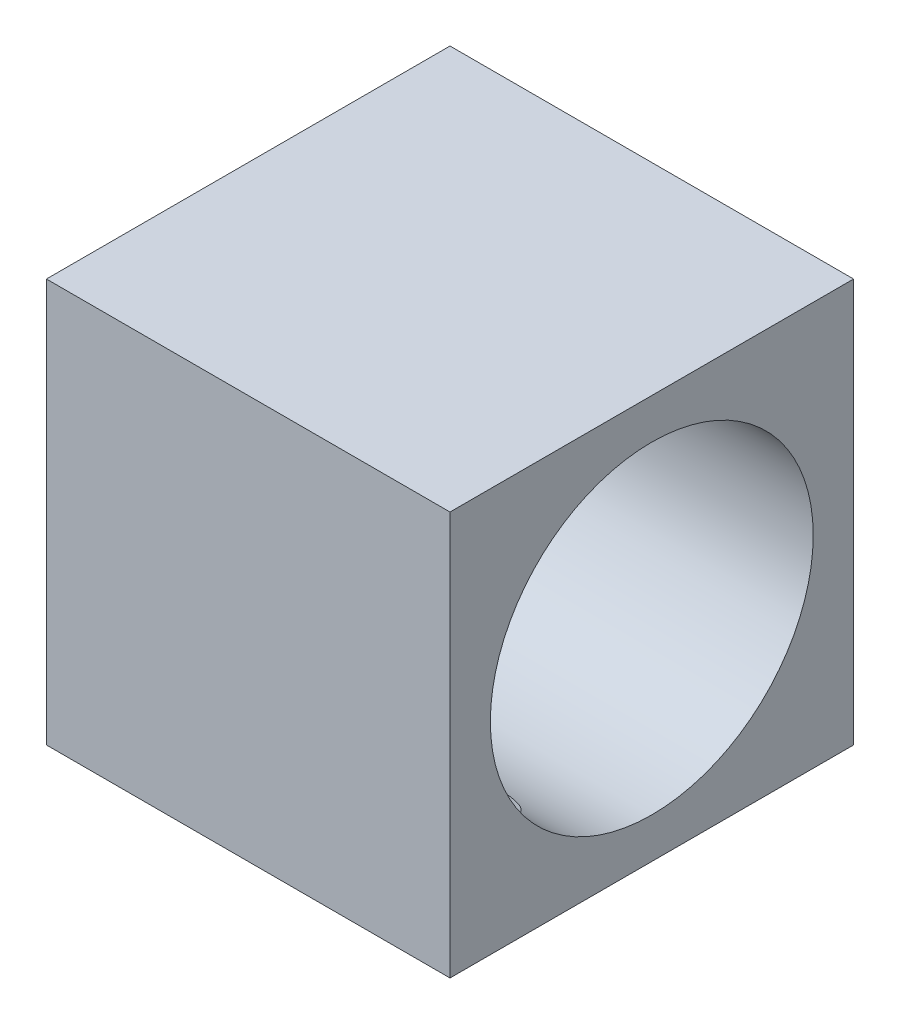
ISO-10303-21;
HEADER;
FILE_DESCRIPTION(('STEP AP214'),'2;1');
FILE_NAME('part.step','',(''),(''),'','','');
FILE_SCHEMA(('AUTOMOTIVE_DESIGN { 1 0 10303 214 1 1 1 1 }'));
ENDSEC;
DATA;
#1=APPLICATION_CONTEXT('core data for automotive mechanical design processes');
#2=APPLICATION_PROTOCOL_DEFINITION('international standard','automotive_design',2000,#1);
#3=PRODUCT_CONTEXT('',#1,'mechanical');
#4=PRODUCT('Part','Part','',(#3));
#5=PRODUCT_RELATED_PRODUCT_CATEGORY('part','',(#4));
#6=PRODUCT_DEFINITION_FORMATION('','',#4);
#7=PRODUCT_DEFINITION_CONTEXT('part definition',#1,'design');
#8=PRODUCT_DEFINITION('design','',#6,#7);
#9=PRODUCT_DEFINITION_SHAPE('','',#8);
#10=(LENGTH_UNIT() NAMED_UNIT(*) SI_UNIT(.MILLI.,.METRE.));
#11=(NAMED_UNIT(*) PLANE_ANGLE_UNIT() SI_UNIT($,.RADIAN.));
#12=(NAMED_UNIT(*) SI_UNIT($,.STERADIAN.) SOLID_ANGLE_UNIT());
#13=UNCERTAINTY_MEASURE_WITH_UNIT(LENGTH_MEASURE(1.E-05),#10,'distance_accuracy_value','');
#14=(GEOMETRIC_REPRESENTATION_CONTEXT(3) GLOBAL_UNCERTAINTY_ASSIGNED_CONTEXT((#13)) GLOBAL_UNIT_ASSIGNED_CONTEXT((#10,
#11,#12)) REPRESENTATION_CONTEXT('',''));
#15=CARTESIAN_POINT('',(0.,0.,0.));
#16=DIRECTION('',(0.,0.,1.));
#17=DIRECTION('',(1.,0.,0.));
#18=AXIS2_PLACEMENT_3D('',#15,#16,#17);
#19=CARTESIAN_POINT('',(10.,20.,10.));
#20=DIRECTION('',(-1.,0.,0.));
#21=DIRECTION('',(0.,0.,1.));
#22=AXIS2_PLACEMENT_3D('',#19,#20,#21);
#23=PLANE('',#22);
#24=CARTESIAN_POINT('',(10.,10.,0.));
#25=DIRECTION('',(-1.,0.,0.));
#26=DIRECTION('',(0.,0.,1.));
#27=AXIS2_PLACEMENT_3D('',#24,#25,#26);
#28=CIRCLE('',#27,8.);
#29=CARTESIAN_POINT('',(10.,10.,8.));
#30=VERTEX_POINT('',#29);
#31=EDGE_CURVE('E140',#30,#30,#28,.F.);
#32=ORIENTED_EDGE('',*,*,#31,.F.);
#33=EDGE_LOOP('',(#32));
#34=FACE_BOUND('',#33,.T.);
#35=DIRECTION('',(0.,0.,-1.));
#36=VECTOR('',#35,1.);
#37=CARTESIAN_POINT('',(10.,0.,10.));
#38=LINE('',#37,#36);
#39=CARTESIAN_POINT('',(10.,0.,10.));
#40=VERTEX_POINT('',#39);
#41=CARTESIAN_POINT('',(10.,0.,-10.));
#42=VERTEX_POINT('',#41);
#43=EDGE_CURVE('E145',#40,#42,#38,.T.);
#44=ORIENTED_EDGE('',*,*,#43,.T.);
#45=DIRECTION('',(0.,-1.,0.));
#46=VECTOR('',#45,1.);
#47=CARTESIAN_POINT('',(10.,20.,-10.));
#48=LINE('',#47,#46);
#49=CARTESIAN_POINT('',(10.,20.,-10.));
#50=VERTEX_POINT('',#49);
#51=EDGE_CURVE('E96',#50,#42,#48,.T.);
#52=ORIENTED_EDGE('',*,*,#51,.F.);
#53=DIRECTION('',(0.,0.,-1.));
#54=VECTOR('',#53,1.);
#55=CARTESIAN_POINT('',(10.,20.,10.));
#56=LINE('',#55,#54);
#57=CARTESIAN_POINT('',(10.,20.,10.));
#58=VERTEX_POINT('',#57);
#59=EDGE_CURVE('E165',#58,#50,#56,.T.);
#60=ORIENTED_EDGE('',*,*,#59,.F.);
#61=DIRECTION('',(0.,-1.,0.));
#62=VECTOR('',#61,1.);
#63=CARTESIAN_POINT('',(10.,20.,10.));
#64=LINE('',#63,#62);
#65=EDGE_CURVE('E149',#58,#40,#64,.T.);
#66=ORIENTED_EDGE('',*,*,#65,.T.);
#67=EDGE_LOOP('',(#44,#52,#60,#66));
#68=FACE_BOUND('',#67,.T.);
#69=ADVANCED_FACE('F36',(#34,#68),#23,.F.);
#70=CARTESIAN_POINT('',(-10.,20.,-10.));
#71=DIRECTION('',(0.,0.,1.));
#72=DIRECTION('',(1.,0.,0.));
#73=AXIS2_PLACEMENT_3D('',#70,#71,#72);
#74=PLANE('',#73);
#75=DIRECTION('',(-1.,0.,0.));
#76=VECTOR('',#75,1.);
#77=CARTESIAN_POINT('',(-10.,0.,-10.));
#78=LINE('',#77,#76);
#79=CARTESIAN_POINT('',(-10.,0.,-10.));
#80=VERTEX_POINT('',#79);
#81=EDGE_CURVE('E152',#42,#80,#78,.T.);
#82=ORIENTED_EDGE('',*,*,#81,.T.);
#83=DIRECTION('',(0.,-1.,0.));
#84=VECTOR('',#83,1.);
#85=CARTESIAN_POINT('',(-10.,20.,-10.));
#86=LINE('',#85,#84);
#87=CARTESIAN_POINT('',(-10.,20.,-10.));
#88=VERTEX_POINT('',#87);
#89=EDGE_CURVE('E170',#88,#80,#86,.T.);
#90=ORIENTED_EDGE('',*,*,#89,.F.);
#91=DIRECTION('',(-1.,0.,0.));
#92=VECTOR('',#91,1.);
#93=CARTESIAN_POINT('',(-10.,20.,-10.));
#94=LINE('',#93,#92);
#95=EDGE_CURVE('E183',#50,#88,#94,.T.);
#96=ORIENTED_EDGE('',*,*,#95,.F.);
#97=ORIENTED_EDGE('',*,*,#51,.T.);
#98=EDGE_LOOP('',(#82,#90,#96,#97));
#99=FACE_BOUND('',#98,.T.);
#100=ADVANCED_FACE('F130',(#99),#74,.F.);
#101=CARTESIAN_POINT('',(-10.,20.,10.));
#102=DIRECTION('',(1.,0.,0.));
#103=DIRECTION('',(0.,0.,-1.));
#104=AXIS2_PLACEMENT_3D('',#101,#102,#103);
#105=PLANE('',#104);
#106=CARTESIAN_POINT('',(-10.,10.,0.));
#107=DIRECTION('',(1.,0.,0.));
#108=DIRECTION('',(0.,0.,-1.));
#109=AXIS2_PLACEMENT_3D('',#106,#107,#108);
#110=CIRCLE('',#109,8.);
#111=CARTESIAN_POINT('',(-10.,10.,-8.));
#112=VERTEX_POINT('',#111);
#113=EDGE_CURVE('E156',#112,#112,#110,.F.);
#114=ORIENTED_EDGE('',*,*,#113,.F.);
#115=EDGE_LOOP('',(#114));
#116=FACE_BOUND('',#115,.T.);
#117=DIRECTION('',(0.,0.,1.));
#118=VECTOR('',#117,1.);
#119=CARTESIAN_POINT('',(-10.,0.,10.));
#120=LINE('',#119,#118);
#121=CARTESIAN_POINT('',(-10.,0.,10.));
#122=VERTEX_POINT('',#121);
#123=EDGE_CURVE('E154',#80,#122,#120,.T.);
#124=ORIENTED_EDGE('',*,*,#123,.T.);
#125=DIRECTION('',(0.,-1.,0.));
#126=VECTOR('',#125,1.);
#127=CARTESIAN_POINT('',(-10.,20.,10.));
#128=LINE('',#127,#126);
#129=CARTESIAN_POINT('',(-10.,20.,10.));
#130=VERTEX_POINT('',#129);
#131=EDGE_CURVE('E167',#130,#122,#128,.T.);
#132=ORIENTED_EDGE('',*,*,#131,.F.);
#133=DIRECTION('',(0.,0.,1.));
#134=VECTOR('',#133,1.);
#135=CARTESIAN_POINT('',(-10.,20.,10.));
#136=LINE('',#135,#134);
#137=EDGE_CURVE('E184',#88,#130,#136,.T.);
#138=ORIENTED_EDGE('',*,*,#137,.F.);
#139=ORIENTED_EDGE('',*,*,#89,.T.);
#140=EDGE_LOOP('',(#124,#132,#138,#139));
#141=FACE_BOUND('',#140,.T.);
#142=ADVANCED_FACE('F135',(#116,#141),#105,.F.);
#143=CARTESIAN_POINT('',(-10.,20.,10.));
#144=DIRECTION('',(0.,0.,-1.));
#145=DIRECTION('',(-1.,0.,0.));
#146=AXIS2_PLACEMENT_3D('',#143,#144,#145);
#147=PLANE('',#146);
#148=DIRECTION('',(1.,0.,0.));
#149=VECTOR('',#148,1.);
#150=CARTESIAN_POINT('',(-10.,0.,10.));
#151=LINE('',#150,#149);
#152=EDGE_CURVE('E163',#122,#40,#151,.T.);
#153=ORIENTED_EDGE('',*,*,#152,.T.);
#154=ORIENTED_EDGE('',*,*,#65,.F.);
#155=DIRECTION('',(1.,0.,0.));
#156=VECTOR('',#155,1.);
#157=CARTESIAN_POINT('',(-10.,20.,10.));
#158=LINE('',#157,#156);
#159=EDGE_CURVE('E159',#130,#58,#158,.T.);
#160=ORIENTED_EDGE('',*,*,#159,.F.);
#161=ORIENTED_EDGE('',*,*,#131,.T.);
#162=EDGE_LOOP('',(#153,#154,#160,#161));
#163=FACE_BOUND('',#162,.T.);
#164=ADVANCED_FACE('F191',(#163),#147,.F.);
#165=CARTESIAN_POINT('',(0.,20.,0.));
#166=DIRECTION('',(0.,-1.,0.));
#167=DIRECTION('',(0.,0.,-1.));
#168=AXIS2_PLACEMENT_3D('',#165,#166,#167);
#169=PLANE('',#168);
#170=ORIENTED_EDGE('',*,*,#59,.T.);
#171=ORIENTED_EDGE('',*,*,#95,.T.);
#172=ORIENTED_EDGE('',*,*,#137,.T.);
#173=ORIENTED_EDGE('',*,*,#159,.T.);
#174=EDGE_LOOP('',(#170,#171,#172,#173));
#175=FACE_BOUND('',#174,.T.);
#176=ADVANCED_FACE('F189',(#175),#169,.F.);
#177=CARTESIAN_POINT('',(0.,0.,0.));
#178=DIRECTION('',(0.,-1.,0.));
#179=DIRECTION('',(0.,0.,-1.));
#180=AXIS2_PLACEMENT_3D('',#177,#178,#179);
#181=PLANE('',#180);
#182=CARTESIAN_POINT('',(6.,0.,6.));
#183=DIRECTION('',(0.,-1.,0.));
#184=DIRECTION('',(0.,0.,-1.));
#185=AXIS2_PLACEMENT_3D('',#182,#183,#184);
#186=CIRCLE('',#185,2.5);
#187=CARTESIAN_POINT('',(6.,0.,3.5));
#188=VERTEX_POINT('',#187);
#189=EDGE_CURVE('E101',#188,#188,#186,.T.);
#190=ORIENTED_EDGE('',*,*,#189,.F.);
#191=EDGE_LOOP('',(#190));
#192=FACE_BOUND('',#191,.T.);
#193=CARTESIAN_POINT('',(-6.,0.,-6.));
#194=DIRECTION('',(0.,-1.,0.));
#195=DIRECTION('',(0.,0.,-1.));
#196=AXIS2_PLACEMENT_3D('',#193,#194,#195);
#197=CIRCLE('',#196,2.5);
#198=CARTESIAN_POINT('',(-6.,0.,-8.5));
#199=VERTEX_POINT('',#198);
#200=EDGE_CURVE('E102',#199,#199,#197,.T.);
#201=ORIENTED_EDGE('',*,*,#200,.F.);
#202=EDGE_LOOP('',(#201));
#203=FACE_BOUND('',#202,.T.);
#204=ORIENTED_EDGE('',*,*,#43,.F.);
#205=ORIENTED_EDGE('',*,*,#152,.F.);
#206=ORIENTED_EDGE('',*,*,#123,.F.);
#207=ORIENTED_EDGE('',*,*,#81,.F.);
#208=EDGE_LOOP('',(#204,#205,#206,#207));
#209=FACE_BOUND('',#208,.T.);
#210=ADVANCED_FACE('F193',(#192,#203,#209),#181,.T.);
#211=CARTESIAN_POINT('',(20.,10.,0.));
#212=DIRECTION('',(-1.,0.,0.));
#213=DIRECTION('',(0.,0.,1.));
#214=AXIS2_PLACEMENT_3D('',#211,#212,#213);
#215=CYLINDRICAL_SURFACE('',#214,8.);
#216=CARTESIAN_POINT('',(8.48796623385061,5.,6.2449979983984));
#217=CARTESIAN_POINT('',(8.49440512151083,4.9182191086807,6.17953317976628));
#218=CARTESIAN_POINT('',(8.4984199590485,4.83758756548305,6.11232821312474));
#219=CARTESIAN_POINT('',(8.50082339914307,4.67886045842261,5.97465395242024));
#220=CARTESIAN_POINT('',(8.49920311774751,4.60076909501457,5.90417967689165));
#221=CARTESIAN_POINT('',(8.4894908762768,4.44695384383401,5.75976596846223));
#222=CARTESIAN_POINT('',(8.48134274696088,4.37125645705471,5.68580172696434));
#223=CARTESIAN_POINT('',(8.45766195834443,4.22346441763205,5.53558892043046));
#224=CARTESIAN_POINT('',(8.44213388435333,4.15136755860332,5.45934180131788));
#225=CARTESIAN_POINT('',(8.3912185133848,3.96981490122556,5.25967889880861));
#226=CARTESIAN_POINT('',(8.34951944774044,3.86341889947069,5.13497940076441));
#227=CARTESIAN_POINT('',(8.24214761932089,3.66339647012983,4.88598191919104));
#228=CARTESIAN_POINT('',(8.17654651773459,3.56973300957475,4.76168384440851));
#229=CARTESIAN_POINT('',(8.0583934914345,3.4398422502417,4.57930772511916));
#230=CARTESIAN_POINT('',(8.0154030810878,3.39809791469104,4.51884885408844));
#231=CARTESIAN_POINT('',(7.92278747380106,3.31860725461287,4.40046045015326));
#232=CARTESIAN_POINT('',(7.87316581227591,3.28085881878066,4.34252959113554));
#233=CARTESIAN_POINT('',(7.76735883421146,3.20954079920865,4.2301419599079));
#234=CARTESIAN_POINT('',(7.71117185738358,3.17597227697096,4.17568607188252));
#235=CARTESIAN_POINT('',(7.59257794390635,3.11317462936695,4.07128351973952));
#236=CARTESIAN_POINT('',(7.5301722369749,3.08394464891383,4.02133596783272));
#237=CARTESIAN_POINT('',(7.3535411907652,3.01085866016393,3.89364770009394));
#238=CARTESIAN_POINT('',(7.23373033330652,2.9711679105349,3.82105554352932));
#239=CARTESIAN_POINT('',(6.98082971826637,2.90466534271641,3.69611903413065));
#240=CARTESIAN_POINT('',(6.84774827187276,2.87784552406707,3.64376210720261));
#241=CARTESIAN_POINT('',(6.58640554281574,2.83877719507831,3.56631103553167));
#242=CARTESIAN_POINT('',(6.45896163457568,2.82535320210733,3.5390387178643));
#243=CARTESIAN_POINT('',(6.20074921172756,2.80850228009595,3.50467420361018));
#244=CARTESIAN_POINT('',(6.06998158845012,2.80507269877062,3.49757665312065));
#245=CARTESIAN_POINT('',(5.81279735358389,2.80810076843478,3.50379627213292));
#246=CARTESIAN_POINT('',(5.68636296016658,2.81427940023251,3.51653734839165));
#247=CARTESIAN_POINT('',(5.43767806087762,2.83610656245158,3.56079103268519));
#248=CARTESIAN_POINT('',(5.31542724313633,2.85175438534887,3.59230223824078));
#249=CARTESIAN_POINT('',(5.07841935067099,2.89272577387763,3.6726928786814));
#250=CARTESIAN_POINT('',(4.96366708783026,2.91805548242373,3.72158333888783));
#251=CARTESIAN_POINT('',(4.74471196848776,2.97854997862801,3.8344912059759));
#252=CARTESIAN_POINT('',(4.64050928997457,3.01371493218505,3.89850886801719));
#253=CARTESIAN_POINT('',(4.44231397537162,3.09495342489793,4.04069188843684));
#254=CARTESIAN_POINT('',(4.34867338380069,3.1412960935843,4.1191928421649));
#255=CARTESIAN_POINT('',(4.17651329216476,3.24401234294148,4.28557804474936));
#256=CARTESIAN_POINT('',(4.09799652566815,3.3003877334489,4.37346398544934));
#257=CARTESIAN_POINT('',(3.95114719826231,3.4272386543868,4.5620923804195));
#258=CARTESIAN_POINT('',(3.88407484204921,3.49846818198149,4.66330337218317));
#259=CARTESIAN_POINT('',(3.76758086548364,3.65068100276003,4.86851876893921));
#260=CARTESIAN_POINT('',(3.71817105390538,3.73167077322509,4.9725249929937));
#261=CARTESIAN_POINT('',(3.64650661953255,3.87961387171259,5.15273774714884));
#262=CARTESIAN_POINT('',(3.6205282682522,3.94466785455901,5.22907199702326));
#263=CARTESIAN_POINT('',(3.57667933331676,4.07884760520405,5.38053770601013));
#264=CARTESIAN_POINT('',(3.55881256431506,4.14797527151502,5.45566858322077));
#265=CARTESIAN_POINT('',(3.53040524117852,4.28985914432371,5.60400261616036));
#266=CARTESIAN_POINT('',(3.51987360109863,4.36261965102978,5.67720332271221));
#267=CARTESIAN_POINT('',(3.50536615629116,4.51126611037256,5.82103923647263));
#268=CARTESIAN_POINT('',(3.50139119381479,4.587152463263,5.89167411294277));
#269=CARTESIAN_POINT('',(3.4995385030118,4.71915895381348,6.00983553714231));
#270=CARTESIAN_POINT('',(3.50022304904934,4.77460470669421,6.05810501339423));
#271=CARTESIAN_POINT('',(3.50422934672421,4.88651472534634,6.15285517199118));
#272=CARTESIAN_POINT('',(3.50754003936523,4.94297375177224,6.19934250043307));
#273=CARTESIAN_POINT('',(3.51203376614939,5.,6.2449979983984));
#274=B_SPLINE_CURVE_WITH_KNOTS('',3,(#216,#217,#218,#219,#220,#221,#222,#223,#224,#225,#226,
#227,#228,#229,#230,#231,#232,#233,#234,#235,#236,#237,#238,#239,#240,#241,#242,#243,#244,#245,
#246,#247,#248,#249,#250,#251,#252,#253,#254,#255,#256,#257,#258,#259,#260,#261,#262,#263,#264,
#265,#266,#267,#268,#269,#270,#271,#272,#273),.UNSPECIFIED.,.F.,.F.,(4,2,2,2,2,2,2,2,2,2,2,2,2,
2,2,2,2,2,2,2,2,2,2,2,2,2,2,2,4),(0.,0.314872034204152,0.63024069951691,0.948352498368765,
1.26626690577826,1.77178181842539,2.27579344244489,2.53083522933031,2.78574158056732,
3.04071253461259,3.29563316930207,3.72977877190493,4.16365416267618,4.55477314177916,
4.94578831752452,5.32565880436046,5.7055009113359,6.08558441975848,6.46567433973698,
6.85603651683806,7.24646918420503,7.66714880994174,8.08810916874629,8.39852000793647,
8.70907667395658,9.0200100902065,9.33098344492455,9.55146073478719,9.7710144678196),.UNSPECIFIED.);
#275=CARTESIAN_POINT('',(8.48796623385061,5.,6.2449979983984));
#276=VERTEX_POINT('',#275);
#277=CARTESIAN_POINT('',(3.51203376614939,5.,6.2449979983984));
#278=VERTEX_POINT('',#277);
#279=EDGE_CURVE('E11',#276,#278,#274,.T.);
#280=ORIENTED_EDGE('',*,*,#279,.F.);
#281=DIRECTION('',(-1.,0.,0.));
#282=VECTOR('',#281,1.);
#283=CARTESIAN_POINT('',(20.,5.,6.2449979983984));
#284=LINE('',#283,#282);
#285=EDGE_CURVE('E49',#276,#278,#284,.T.);
#286=ORIENTED_EDGE('',*,*,#285,.T.);
#287=EDGE_LOOP('',(#280,#286));
#288=FACE_BOUND('',#287,.T.);
#289=CARTESIAN_POINT('',(-8.48796623385061,5.,-6.2449979983984));
#290=CARTESIAN_POINT('',(-8.49440512151082,4.9182191086807,-6.17953317976628));
#291=CARTESIAN_POINT('',(-8.4984199590485,4.83758756548305,-6.11232821312474));
#292=CARTESIAN_POINT('',(-8.50082339914306,4.67886045842261,-5.97465395242024));
#293=CARTESIAN_POINT('',(-8.49920311774751,4.60076909501457,-5.90417967689165));
#294=CARTESIAN_POINT('',(-8.4894908762768,4.44695384383401,-5.75976596846223));
#295=CARTESIAN_POINT('',(-8.48134274696088,4.37125645705471,-5.68580172696435));
#296=CARTESIAN_POINT('',(-8.45766195834442,4.22346441763205,-5.53558892043046));
#297=CARTESIAN_POINT('',(-8.44213388435332,4.15136755860332,-5.45934180131788));
#298=CARTESIAN_POINT('',(-8.3912185133848,3.96981490122556,-5.25967889880861));
#299=CARTESIAN_POINT('',(-8.34951944774044,3.86341889947069,-5.13497940076441));
#300=CARTESIAN_POINT('',(-8.24214761932089,3.66339647012983,-4.88598191919104));
#301=CARTESIAN_POINT('',(-8.17654651773459,3.56973300957475,-4.76168384440851));
#302=CARTESIAN_POINT('',(-8.0583934914345,3.4398422502417,-4.57930772511916));
#303=CARTESIAN_POINT('',(-8.0154030810878,3.39809791469103,-4.51884885408844));
#304=CARTESIAN_POINT('',(-7.92278747380106,3.31860725461287,-4.40046045015326));
#305=CARTESIAN_POINT('',(-7.87316581227591,3.28085881878066,-4.34252959113554));
#306=CARTESIAN_POINT('',(-7.76735883421146,3.20954079920865,-4.2301419599079));
#307=CARTESIAN_POINT('',(-7.71117185738358,3.17597227697096,-4.17568607188252));
#308=CARTESIAN_POINT('',(-7.59257794390635,3.11317462936695,-4.07128351973952));
#309=CARTESIAN_POINT('',(-7.5301722369749,3.08394464891383,-4.02133596783272));
#310=CARTESIAN_POINT('',(-7.3535411907652,3.01085866016393,-3.89364770009394));
#311=CARTESIAN_POINT('',(-7.23373033330652,2.9711679105349,-3.82105554352932));
#312=CARTESIAN_POINT('',(-6.98082971826636,2.90466534271641,-3.69611903413065));
#313=CARTESIAN_POINT('',(-6.84774827187275,2.87784552406707,-3.64376210720261));
#314=CARTESIAN_POINT('',(-6.58640554281574,2.83877719507831,-3.56631103553167));
#315=CARTESIAN_POINT('',(-6.45896163457567,2.82535320210733,-3.5390387178643));
#316=CARTESIAN_POINT('',(-6.20074921172755,2.80850228009595,-3.50467420361018));
#317=CARTESIAN_POINT('',(-6.06998158845012,2.80507269877062,-3.49757665312065));
#318=CARTESIAN_POINT('',(-5.81279735358389,2.80810076843478,-3.50379627213292));
#319=CARTESIAN_POINT('',(-5.68636296016658,2.81427940023251,-3.51653734839165));
#320=CARTESIAN_POINT('',(-5.43767806087762,2.83610656245158,-3.5607910326852));
#321=CARTESIAN_POINT('',(-5.31542724313633,2.85175438534887,-3.59230223824078));
#322=CARTESIAN_POINT('',(-5.07841935067099,2.89272577387763,-3.6726928786814));
#323=CARTESIAN_POINT('',(-4.96366708783026,2.91805548242373,-3.72158333888783));
#324=CARTESIAN_POINT('',(-4.74471196848776,2.97854997862801,-3.8344912059759));
#325=CARTESIAN_POINT('',(-4.64050928997457,3.01371493218505,-3.8985088680172));
#326=CARTESIAN_POINT('',(-4.44231397537162,3.09495342489794,-4.04069188843684));
#327=CARTESIAN_POINT('',(-4.34867338380068,3.1412960935843,-4.1191928421649));
#328=CARTESIAN_POINT('',(-4.17651329216476,3.24401234294148,-4.28557804474936));
#329=CARTESIAN_POINT('',(-4.09799652566815,3.3003877334489,-4.37346398544934));
#330=CARTESIAN_POINT('',(-3.95114719826231,3.4272386543868,-4.56209238041951));
#331=CARTESIAN_POINT('',(-3.88407484204921,3.4984681819815,-4.66330337218318));
#332=CARTESIAN_POINT('',(-3.76758086548364,3.65068100276003,-4.86851876893921));
#333=CARTESIAN_POINT('',(-3.71817105390538,3.73167077322509,-4.9725249929937));
#334=CARTESIAN_POINT('',(-3.64650661953255,3.8796138717126,-5.15273774714884));
#335=CARTESIAN_POINT('',(-3.6205282682522,3.94466785455901,-5.22907199702326));
#336=CARTESIAN_POINT('',(-3.57667933331676,4.07884760520406,-5.38053770601014));
#337=CARTESIAN_POINT('',(-3.55881256431506,4.14797527151502,-5.45566858322077));
#338=CARTESIAN_POINT('',(-3.53040524117852,4.28985914432371,-5.60400261616036));
#339=CARTESIAN_POINT('',(-3.51987360109863,4.36261965102978,-5.67720332271221));
#340=CARTESIAN_POINT('',(-3.50536615629116,4.51126611037256,-5.82103923647263));
#341=CARTESIAN_POINT('',(-3.5013911938148,4.58715246326301,-5.89167411294277));
#342=CARTESIAN_POINT('',(-3.4995385030118,4.71915895381348,-6.00983553714231));
#343=CARTESIAN_POINT('',(-3.50022304904934,4.77460470669421,-6.05810501339423));
#344=CARTESIAN_POINT('',(-3.50422934672421,4.88651472534634,-6.15285517199118));
#345=CARTESIAN_POINT('',(-3.50754003936523,4.94297375177224,-6.19934250043307));
#346=CARTESIAN_POINT('',(-3.51203376614939,5.,-6.2449979983984));
#347=B_SPLINE_CURVE_WITH_KNOTS('',3,(#289,#290,#291,#292,#293,#294,#295,#296,#297,#298,#299,
#300,#301,#302,#303,#304,#305,#306,#307,#308,#309,#310,#311,#312,#313,#314,#315,#316,#317,#318,
#319,#320,#321,#322,#323,#324,#325,#326,#327,#328,#329,#330,#331,#332,#333,#334,#335,#336,#337,
#338,#339,#340,#341,#342,#343,#344,#345,#346),.UNSPECIFIED.,.F.,.F.,(4,2,2,2,2,2,2,2,2,2,2,2,2,
2,2,2,2,2,2,2,2,2,2,2,2,2,2,2,4),(0.,0.314872034204151,0.630240699516908,0.948352498368763,
1.26626690577826,1.77178181842538,2.27579344244489,2.53083522933031,2.78574158056732,
3.04071253461259,3.29563316930207,3.72977877190493,4.16365416267618,4.55477314177916,
4.94578831752451,5.32565880436046,5.70550091133589,6.08558441975848,6.46567433973698,
6.85603651683806,7.24646918420503,7.66714880994174,8.08810916874629,8.39852000793647,
8.70907667395658,9.02001009020649,9.33098344492454,9.55146073478718,9.7710144678196),.UNSPECIFIED.);
#348=CARTESIAN_POINT('',(-8.48796623385061,5.,-6.2449979983984));
#349=VERTEX_POINT('',#348);
#350=CARTESIAN_POINT('',(-3.51203376614939,5.,-6.2449979983984));
#351=VERTEX_POINT('',#350);
#352=EDGE_CURVE('E95',#349,#351,#347,.T.);
#353=ORIENTED_EDGE('',*,*,#352,.F.);
#354=DIRECTION('',(-1.,0.,0.));
#355=VECTOR('',#354,1.);
#356=CARTESIAN_POINT('',(20.,5.,-6.2449979983984));
#357=LINE('',#356,#355);
#358=EDGE_CURVE('E91',#349,#351,#357,.F.);
#359=ORIENTED_EDGE('',*,*,#358,.T.);
#360=EDGE_LOOP('',(#353,#359));
#361=FACE_BOUND('',#360,.T.);
#362=ORIENTED_EDGE('',*,*,#113,.T.);
#363=EDGE_LOOP('',(#362));
#364=FACE_BOUND('',#363,.T.);
#365=ORIENTED_EDGE('',*,*,#31,.T.);
#366=EDGE_LOOP('',(#365));
#367=FACE_BOUND('',#366,.T.);
#368=ADVANCED_FACE('F104',(#288,#361,#364,#367),#215,.F.);
#369=CARTESIAN_POINT('',(-6.,5.,-6.));
#370=DIRECTION('',(0.,-1.,0.));
#371=DIRECTION('',(0.,0.,-1.));
#372=AXIS2_PLACEMENT_3D('',#369,#370,#371);
#373=CYLINDRICAL_SURFACE('',#372,2.5);
#374=ORIENTED_EDGE('',*,*,#352,.T.);
#375=CARTESIAN_POINT('',(-6.,5.,-6.));
#376=DIRECTION('',(0.,-1.,0.));
#377=DIRECTION('',(0.,0.,-1.));
#378=AXIS2_PLACEMENT_3D('',#375,#376,#377);
#379=CIRCLE('',#378,2.5);
#380=EDGE_CURVE('E61',#349,#351,#379,.T.);
#381=ORIENTED_EDGE('',*,*,#380,.F.);
#382=EDGE_LOOP('',(#374,#381));
#383=FACE_BOUND('',#382,.T.);
#384=ORIENTED_EDGE('',*,*,#200,.T.);
#385=EDGE_LOOP('',(#384));
#386=FACE_BOUND('',#385,.T.);
#387=ADVANCED_FACE('F99',(#383,#386),#373,.F.);
#388=CARTESIAN_POINT('',(-6.,5.,-6.));
#389=DIRECTION('',(0.,-1.,0.));
#390=DIRECTION('',(0.,0.,-1.));
#391=AXIS2_PLACEMENT_3D('',#388,#389,#390);
#392=PLANE('',#391);
#393=ORIENTED_EDGE('',*,*,#380,.T.);
#394=ORIENTED_EDGE('',*,*,#358,.F.);
#395=EDGE_LOOP('',(#393,#394));
#396=FACE_BOUND('',#395,.T.);
#397=ADVANCED_FACE('F92',(#396),#392,.T.);
#398=CARTESIAN_POINT('',(6.,5.,6.));
#399=DIRECTION('',(0.,-1.,0.));
#400=DIRECTION('',(0.,0.,-1.));
#401=AXIS2_PLACEMENT_3D('',#398,#399,#400);
#402=CYLINDRICAL_SURFACE('',#401,2.5);
#403=ORIENTED_EDGE('',*,*,#279,.T.);
#404=CARTESIAN_POINT('',(6.,5.,6.));
#405=DIRECTION('',(0.,-1.,0.));
#406=DIRECTION('',(0.,0.,-1.));
#407=AXIS2_PLACEMENT_3D('',#404,#405,#406);
#408=CIRCLE('',#407,2.5);
#409=EDGE_CURVE('E55',#276,#278,#408,.T.);
#410=ORIENTED_EDGE('',*,*,#409,.F.);
#411=EDGE_LOOP('',(#403,#410));
#412=FACE_BOUND('',#411,.T.);
#413=ORIENTED_EDGE('',*,*,#189,.T.);
#414=EDGE_LOOP('',(#413));
#415=FACE_BOUND('',#414,.T.);
#416=ADVANCED_FACE('F120',(#412,#415),#402,.F.);
#417=CARTESIAN_POINT('',(6.,5.,6.));
#418=DIRECTION('',(0.,-1.,0.));
#419=DIRECTION('',(0.,0.,-1.));
#420=AXIS2_PLACEMENT_3D('',#417,#418,#419);
#421=PLANE('',#420);
#422=ORIENTED_EDGE('',*,*,#409,.T.);
#423=ORIENTED_EDGE('',*,*,#285,.F.);
#424=EDGE_LOOP('',(#422,#423));
#425=FACE_BOUND('',#424,.T.);
#426=ADVANCED_FACE('F124',(#425),#421,.T.);
#427=CLOSED_SHELL('',(#69,#100,#142,#164,#176,#210,#368,#387,#397,#416,#426));
#428=MANIFOLD_SOLID_BREP('B2',#427);
#429=ADVANCED_BREP_SHAPE_REPRESENTATION('',(#18,#428),#14);
#430=SHAPE_DEFINITION_REPRESENTATION(#9,#429);
ENDSEC;
END-ISO-10303-21;
